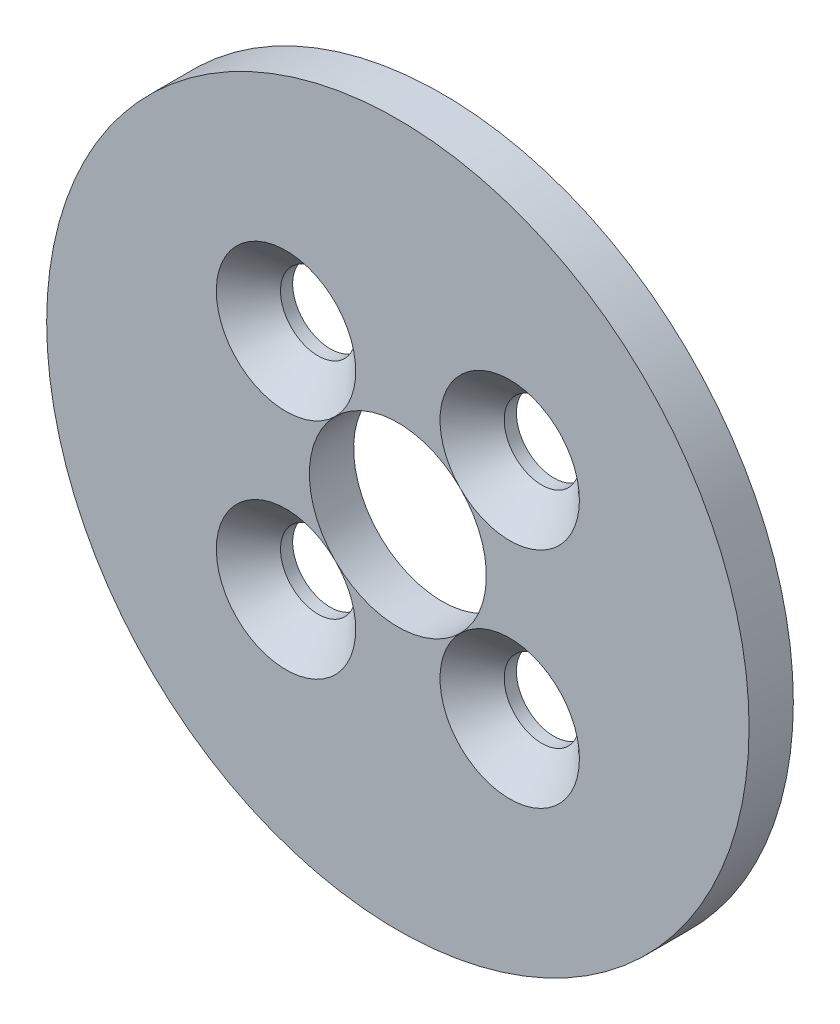
ISO-10303-21;
HEADER;
FILE_DESCRIPTION(('STEP AP214'),'2;1');
FILE_NAME('part.step','',(''),(''),'','','');
FILE_SCHEMA(('AUTOMOTIVE_DESIGN { 1 0 10303 214 1 1 1 1 }'));
ENDSEC;
DATA;
#1=APPLICATION_CONTEXT('core data for automotive mechanical design processes');
#2=APPLICATION_PROTOCOL_DEFINITION('international standard','automotive_design',2000,#1);
#3=PRODUCT_CONTEXT('',#1,'mechanical');
#4=PRODUCT('Part','Part','',(#3));
#5=PRODUCT_RELATED_PRODUCT_CATEGORY('part','',(#4));
#6=PRODUCT_DEFINITION_FORMATION('','',#4);
#7=PRODUCT_DEFINITION_CONTEXT('part definition',#1,'design');
#8=PRODUCT_DEFINITION('design','',#6,#7);
#9=PRODUCT_DEFINITION_SHAPE('','',#8);
#10=(LENGTH_UNIT() NAMED_UNIT(*) SI_UNIT(.MILLI.,.METRE.));
#11=(NAMED_UNIT(*) PLANE_ANGLE_UNIT() SI_UNIT($,.RADIAN.));
#12=(NAMED_UNIT(*) SI_UNIT($,.STERADIAN.) SOLID_ANGLE_UNIT());
#13=UNCERTAINTY_MEASURE_WITH_UNIT(LENGTH_MEASURE(1.E-05),#10,'distance_accuracy_value','');
#14=(GEOMETRIC_REPRESENTATION_CONTEXT(3) GLOBAL_UNCERTAINTY_ASSIGNED_CONTEXT((#13)) GLOBAL_UNIT_ASSIGNED_CONTEXT((#10,
#11,#12)) REPRESENTATION_CONTEXT('',''));
#15=CARTESIAN_POINT('',(0.,0.,0.));
#16=DIRECTION('',(0.,0.,1.));
#17=DIRECTION('',(1.,0.,0.));
#18=AXIS2_PLACEMENT_3D('',#15,#16,#17);
#19=CARTESIAN_POINT('',(-165.662570111801,103.941444968287,2.));
#20=DIRECTION('',(0.,0.,-1.));
#21=DIRECTION('',(-1.,0.,0.));
#22=AXIS2_PLACEMENT_3D('',#19,#20,#21);
#23=CYLINDRICAL_SURFACE('',#22,1.70000000000001);
#24=CARTESIAN_POINT('',(-165.662570111801,103.941444968287,0.));
#25=DIRECTION('',(0.,0.,1.));
#26=DIRECTION('',(1.,0.,0.));
#27=AXIS2_PLACEMENT_3D('',#24,#25,#26);
#28=CIRCLE('',#27,1.70000000000001);
#29=CARTESIAN_POINT('',(-163.962570111801,103.941444968287,0.));
#30=VERTEX_POINT('',#29);
#31=EDGE_CURVE('E98',#30,#30,#28,.T.);
#32=ORIENTED_EDGE('',*,*,#31,.F.);
#33=EDGE_LOOP('',(#32));
#34=FACE_BOUND('',#33,.T.);
#35=CARTESIAN_POINT('',(-165.662570111801,103.941444968287,0.549999999999993));
#36=DIRECTION('',(0.,0.,1.));
#37=DIRECTION('',(1.,0.,0.));
#38=AXIS2_PLACEMENT_3D('',#35,#36,#37);
#39=CIRCLE('',#38,1.69999999999998);
#40=CARTESIAN_POINT('',(-163.962570111801,103.941444968287,0.549999999999993));
#41=VERTEX_POINT('',#40);
#42=EDGE_CURVE('E202',#41,#41,#39,.T.);
#43=ORIENTED_EDGE('',*,*,#42,.T.);
#44=EDGE_LOOP('',(#43));
#45=FACE_BOUND('',#44,.T.);
#46=ADVANCED_FACE('F32',(#34,#45),#23,.F.);
#47=CARTESIAN_POINT('',(-155.550943140833,103.941444968288,2.));
#48=DIRECTION('',(0.,0.,-1.));
#49=DIRECTION('',(-1.,0.,0.));
#50=AXIS2_PLACEMENT_3D('',#47,#48,#49);
#51=CYLINDRICAL_SURFACE('',#50,1.70000000000001);
#52=CARTESIAN_POINT('',(-155.550943140833,103.941444968288,0.));
#53=DIRECTION('',(0.,0.,1.));
#54=DIRECTION('',(1.,0.,0.));
#55=AXIS2_PLACEMENT_3D('',#52,#53,#54);
#56=CIRCLE('',#55,1.70000000000001);
#57=CARTESIAN_POINT('',(-153.850943140833,103.941444968288,0.));
#58=VERTEX_POINT('',#57);
#59=EDGE_CURVE('E92',#58,#58,#56,.T.);
#60=ORIENTED_EDGE('',*,*,#59,.F.);
#61=EDGE_LOOP('',(#60));
#62=FACE_BOUND('',#61,.T.);
#63=CARTESIAN_POINT('',(-155.550943140833,103.941444968288,0.549999999999993));
#64=DIRECTION('',(0.,0.,1.));
#65=DIRECTION('',(1.,0.,0.));
#66=AXIS2_PLACEMENT_3D('',#63,#64,#65);
#67=CIRCLE('',#66,1.69999999999998);
#68=CARTESIAN_POINT('',(-153.850943140833,103.941444968288,0.549999999999993));
#69=VERTEX_POINT('',#68);
#70=EDGE_CURVE('E204',#69,#69,#67,.T.);
#71=ORIENTED_EDGE('',*,*,#70,.T.);
#72=EDGE_LOOP('',(#71));
#73=FACE_BOUND('',#72,.T.);
#74=ADVANCED_FACE('F137',(#62,#73),#51,.F.);
#75=CARTESIAN_POINT('',(-155.550943140833,93.82981799732,2.));
#76=DIRECTION('',(0.,0.,-1.));
#77=DIRECTION('',(-1.,0.,0.));
#78=AXIS2_PLACEMENT_3D('',#75,#76,#77);
#79=CYLINDRICAL_SURFACE('',#78,1.70000000000001);
#80=CARTESIAN_POINT('',(-155.550943140833,93.82981799732,0.));
#81=DIRECTION('',(0.,0.,1.));
#82=DIRECTION('',(1.,0.,0.));
#83=AXIS2_PLACEMENT_3D('',#80,#81,#82);
#84=CIRCLE('',#83,1.70000000000001);
#85=CARTESIAN_POINT('',(-153.850943140833,93.82981799732,0.));
#86=VERTEX_POINT('',#85);
#87=EDGE_CURVE('E89',#86,#86,#84,.T.);
#88=ORIENTED_EDGE('',*,*,#87,.F.);
#89=EDGE_LOOP('',(#88));
#90=FACE_BOUND('',#89,.T.);
#91=CARTESIAN_POINT('',(-155.550943140833,93.82981799732,0.549999999999993));
#92=DIRECTION('',(0.,0.,1.));
#93=DIRECTION('',(1.,0.,0.));
#94=AXIS2_PLACEMENT_3D('',#91,#92,#93);
#95=CIRCLE('',#94,1.69999999999998);
#96=CARTESIAN_POINT('',(-153.850943140833,93.82981799732,0.549999999999993));
#97=VERTEX_POINT('',#96);
#98=EDGE_CURVE('E77',#97,#97,#95,.T.);
#99=ORIENTED_EDGE('',*,*,#98,.T.);
#100=EDGE_LOOP('',(#99));
#101=FACE_BOUND('',#100,.T.);
#102=ADVANCED_FACE('F121',(#90,#101),#79,.F.);
#103=CARTESIAN_POINT('',(-165.6625701118,93.8298179973198,2.));
#104=DIRECTION('',(0.,0.,-1.));
#105=DIRECTION('',(-1.,0.,0.));
#106=AXIS2_PLACEMENT_3D('',#103,#104,#105);
#107=CYLINDRICAL_SURFACE('',#106,1.70000000000001);
#108=CARTESIAN_POINT('',(-165.6625701118,93.8298179973198,0.));
#109=DIRECTION('',(0.,0.,1.));
#110=DIRECTION('',(1.,0.,0.));
#111=AXIS2_PLACEMENT_3D('',#108,#109,#110);
#112=CIRCLE('',#111,1.70000000000001);
#113=CARTESIAN_POINT('',(-163.9625701118,93.8298179973198,0.));
#114=VERTEX_POINT('',#113);
#115=EDGE_CURVE('E80',#114,#114,#112,.T.);
#116=ORIENTED_EDGE('',*,*,#115,.F.);
#117=EDGE_LOOP('',(#116));
#118=FACE_BOUND('',#117,.T.);
#119=CARTESIAN_POINT('',(-165.6625701118,93.8298179973198,0.549999999999993));
#120=DIRECTION('',(0.,0.,1.));
#121=DIRECTION('',(1.,0.,0.));
#122=AXIS2_PLACEMENT_3D('',#119,#120,#121);
#123=CIRCLE('',#122,1.69999999999998);
#124=CARTESIAN_POINT('',(-163.9625701118,93.8298179973198,0.549999999999993));
#125=VERTEX_POINT('',#124);
#126=EDGE_CURVE('E76',#125,#125,#123,.T.);
#127=ORIENTED_EDGE('',*,*,#126,.T.);
#128=EDGE_LOOP('',(#127));
#129=FACE_BOUND('',#128,.T.);
#130=ADVANCED_FACE('F118',(#118,#129),#107,.F.);
#131=CARTESIAN_POINT('',(-160.606756626317,98.8856314828036,2.));
#132=DIRECTION('',(0.,0.,1.));
#133=DIRECTION('',(1.,0.,0.));
#134=AXIS2_PLACEMENT_3D('',#131,#132,#133);
#135=PLANE('',#134);
#136=CARTESIAN_POINT('',(-160.606756626317,98.8856314828036,2.));
#137=DIRECTION('',(0.,0.,1.));
#138=DIRECTION('',(1.,0.,0.));
#139=AXIS2_PLACEMENT_3D('',#136,#137,#138);
#140=CIRCLE('',#139,15.875);
#141=CARTESIAN_POINT('',(-144.731756626317,98.8856314828036,2.));
#142=VERTEX_POINT('',#141);
#143=EDGE_CURVE('E11',#142,#142,#140,.T.);
#144=ORIENTED_EDGE('',*,*,#143,.T.);
#145=EDGE_LOOP('',(#144));
#146=FACE_BOUND('',#145,.T.);
#147=CARTESIAN_POINT('',(-160.606756626317,98.8856314828036,2.));
#148=DIRECTION('',(0.,0.,1.));
#149=DIRECTION('',(1.,0.,0.));
#150=AXIS2_PLACEMENT_3D('',#147,#148,#149);
#151=CIRCLE('',#150,3.99999999999999);
#152=CARTESIAN_POINT('',(-163.435183751065,101.714058607548,2.));
#153=VERTEX_POINT('',#152);
#154=CARTESIAN_POINT('',(-163.435183751064,96.0572043580586,2.));
#155=VERTEX_POINT('',#154);
#156=EDGE_CURVE('E60',#153,#155,#151,.T.);
#157=ORIENTED_EDGE('',*,*,#156,.F.);
#158=CARTESIAN_POINT('',(-165.662570111801,103.941444968287,2.));
#159=DIRECTION('',(0.,0.,1.));
#160=DIRECTION('',(1.,0.,0.));
#161=AXIS2_PLACEMENT_3D('',#158,#159,#160);
#162=CIRCLE('',#161,3.15000000000001);
#163=EDGE_CURVE('E45',#153,#153,#162,.T.);
#164=ORIENTED_EDGE('',*,*,#163,.F.);
#165=CARTESIAN_POINT('',(-157.77832950157,101.714058607549,2.));
#166=VERTEX_POINT('',#165);
#167=EDGE_CURVE('E68',#166,#153,#151,.T.);
#168=ORIENTED_EDGE('',*,*,#167,.F.);
#169=CARTESIAN_POINT('',(-155.550943140833,103.941444968288,2.));
#170=DIRECTION('',(0.,0.,1.));
#171=DIRECTION('',(1.,0.,0.));
#172=AXIS2_PLACEMENT_3D('',#169,#170,#171);
#173=CIRCLE('',#172,3.15000000000001);
#174=EDGE_CURVE('E50',#166,#166,#173,.T.);
#175=ORIENTED_EDGE('',*,*,#174,.F.);
#176=CARTESIAN_POINT('',(-157.778329501571,96.0572043580566,2.));
#177=VERTEX_POINT('',#176);
#178=EDGE_CURVE('E93',#177,#166,#151,.T.);
#179=ORIENTED_EDGE('',*,*,#178,.F.);
#180=CARTESIAN_POINT('',(-155.550943140833,93.82981799732,2.));
#181=DIRECTION('',(0.,0.,1.));
#182=DIRECTION('',(1.,0.,0.));
#183=AXIS2_PLACEMENT_3D('',#180,#181,#182);
#184=CIRCLE('',#183,3.15000000000001);
#185=EDGE_CURVE('E83',#177,#177,#184,.T.);
#186=ORIENTED_EDGE('',*,*,#185,.F.);
#187=EDGE_CURVE('E66',#155,#177,#151,.T.);
#188=ORIENTED_EDGE('',*,*,#187,.F.);
#189=CARTESIAN_POINT('',(-165.6625701118,93.8298179973198,2.));
#190=DIRECTION('',(0.,0.,1.));
#191=DIRECTION('',(1.,0.,0.));
#192=AXIS2_PLACEMENT_3D('',#189,#190,#191);
#193=CIRCLE('',#192,3.14999999999999);
#194=EDGE_CURVE('E74',#155,#155,#193,.T.);
#195=ORIENTED_EDGE('',*,*,#194,.F.);
#196=EDGE_LOOP('',(#157,#164,#168,#175,#179,#186,#188,#195));
#197=FACE_BOUND('',#196,.T.);
#198=ADVANCED_FACE('F108',(#146,#197),#135,.T.);
#199=CARTESIAN_POINT('',(-160.606756626317,98.8856314828036,0.));
#200=DIRECTION('',(0.,0.,1.));
#201=DIRECTION('',(1.,0.,0.));
#202=AXIS2_PLACEMENT_3D('',#199,#200,#201);
#203=PLANE('',#202);
#204=CARTESIAN_POINT('',(-160.606756626317,98.8856314828036,0.));
#205=DIRECTION('',(0.,0.,1.));
#206=DIRECTION('',(1.,0.,0.));
#207=AXIS2_PLACEMENT_3D('',#204,#205,#206);
#208=CIRCLE('',#207,15.875);
#209=CARTESIAN_POINT('',(-144.731756626317,98.8856314828036,0.));
#210=VERTEX_POINT('',#209);
#211=EDGE_CURVE('E36',#210,#210,#208,.T.);
#212=ORIENTED_EDGE('',*,*,#211,.F.);
#213=EDGE_LOOP('',(#212));
#214=FACE_BOUND('',#213,.T.);
#215=ORIENTED_EDGE('',*,*,#31,.T.);
#216=EDGE_LOOP('',(#215));
#217=FACE_BOUND('',#216,.T.);
#218=ORIENTED_EDGE('',*,*,#59,.T.);
#219=EDGE_LOOP('',(#218));
#220=FACE_BOUND('',#219,.T.);
#221=CARTESIAN_POINT('',(-160.606756626317,98.8856314828036,0.));
#222=DIRECTION('',(0.,0.,1.));
#223=DIRECTION('',(1.,0.,0.));
#224=AXIS2_PLACEMENT_3D('',#221,#222,#223);
#225=CIRCLE('',#224,3.99999999999999);
#226=CARTESIAN_POINT('',(-156.606756626317,98.8856314828036,0.));
#227=VERTEX_POINT('',#226);
#228=EDGE_CURVE('E71',#227,#227,#225,.T.);
#229=ORIENTED_EDGE('',*,*,#228,.T.);
#230=EDGE_LOOP('',(#229));
#231=FACE_BOUND('',#230,.T.);
#232=ORIENTED_EDGE('',*,*,#87,.T.);
#233=EDGE_LOOP('',(#232));
#234=FACE_BOUND('',#233,.T.);
#235=ORIENTED_EDGE('',*,*,#115,.T.);
#236=EDGE_LOOP('',(#235));
#237=FACE_BOUND('',#236,.T.);
#238=ADVANCED_FACE('F106',(#214,#217,#220,#231,#234,#237),#203,.F.);
#239=CARTESIAN_POINT('',(-160.606756626317,98.8856314828036,2.));
#240=DIRECTION('',(0.,0.,-1.));
#241=DIRECTION('',(-1.,0.,0.));
#242=AXIS2_PLACEMENT_3D('',#239,#240,#241);
#243=CYLINDRICAL_SURFACE('',#242,15.875);
#244=ORIENTED_EDGE('',*,*,#143,.F.);
#245=EDGE_LOOP('',(#244));
#246=FACE_BOUND('',#245,.T.);
#247=ORIENTED_EDGE('',*,*,#211,.T.);
#248=EDGE_LOOP('',(#247));
#249=FACE_BOUND('',#248,.T.);
#250=ADVANCED_FACE('F34',(#246,#249),#243,.T.);
#251=CARTESIAN_POINT('',(-160.606756626317,98.8856314828036,2.));
#252=DIRECTION('',(0.,0.,-1.));
#253=DIRECTION('',(-1.,0.,0.));
#254=AXIS2_PLACEMENT_3D('',#251,#252,#253);
#255=CYLINDRICAL_SURFACE('',#254,3.99999999999999);
#256=ORIENTED_EDGE('',*,*,#187,.T.);
#257=ORIENTED_EDGE('',*,*,#178,.T.);
#258=ORIENTED_EDGE('',*,*,#167,.T.);
#259=ORIENTED_EDGE('',*,*,#156,.T.);
#260=EDGE_LOOP('',(#256,#257,#258,#259));
#261=FACE_BOUND('',#260,.T.);
#262=ORIENTED_EDGE('',*,*,#228,.F.);
#263=EDGE_LOOP('',(#262));
#264=FACE_BOUND('',#263,.T.);
#265=ADVANCED_FACE('F62',(#261,#264),#255,.F.);
#266=CARTESIAN_POINT('',(-165.6625701118,93.8298179973198,2.));
#267=DIRECTION('',(0.,0.,1.));
#268=DIRECTION('',(1.,0.,0.));
#269=AXIS2_PLACEMENT_3D('',#266,#267,#268);
#270=CONICAL_SURFACE('',#269,3.14999999999999,0.785398163397448);
#271=ORIENTED_EDGE('',*,*,#126,.F.);
#272=EDGE_LOOP('',(#271));
#273=FACE_BOUND('',#272,.T.);
#274=ORIENTED_EDGE('',*,*,#194,.T.);
#275=EDGE_LOOP('',(#274));
#276=FACE_BOUND('',#275,.T.);
#277=ADVANCED_FACE('F75',(#273,#276),#270,.F.);
#278=CARTESIAN_POINT('',(-155.550943140833,93.82981799732,2.));
#279=DIRECTION('',(0.,0.,1.));
#280=DIRECTION('',(1.,0.,0.));
#281=AXIS2_PLACEMENT_3D('',#278,#279,#280);
#282=CONICAL_SURFACE('',#281,3.15000000000001,0.785398163397457);
#283=ORIENTED_EDGE('',*,*,#98,.F.);
#284=EDGE_LOOP('',(#283));
#285=FACE_BOUND('',#284,.T.);
#286=ORIENTED_EDGE('',*,*,#185,.T.);
#287=EDGE_LOOP('',(#286));
#288=FACE_BOUND('',#287,.T.);
#289=ADVANCED_FACE('F126',(#285,#288),#282,.F.);
#290=CARTESIAN_POINT('',(-155.550943140833,103.941444968288,2.));
#291=DIRECTION('',(0.,0.,1.));
#292=DIRECTION('',(1.,0.,0.));
#293=AXIS2_PLACEMENT_3D('',#290,#291,#292);
#294=CONICAL_SURFACE('',#293,3.15000000000001,0.785398163397457);
#295=ORIENTED_EDGE('',*,*,#70,.F.);
#296=EDGE_LOOP('',(#295));
#297=FACE_BOUND('',#296,.T.);
#298=ORIENTED_EDGE('',*,*,#174,.T.);
#299=EDGE_LOOP('',(#298));
#300=FACE_BOUND('',#299,.T.);
#301=ADVANCED_FACE('F132',(#297,#300),#294,.F.);
#302=CARTESIAN_POINT('',(-165.662570111801,103.941444968287,2.));
#303=DIRECTION('',(0.,0.,1.));
#304=DIRECTION('',(1.,0.,0.));
#305=AXIS2_PLACEMENT_3D('',#302,#303,#304);
#306=CONICAL_SURFACE('',#305,3.15000000000001,0.785398163397457);
#307=ORIENTED_EDGE('',*,*,#42,.F.);
#308=EDGE_LOOP('',(#307));
#309=FACE_BOUND('',#308,.T.);
#310=ORIENTED_EDGE('',*,*,#163,.T.);
#311=EDGE_LOOP('',(#310));
#312=FACE_BOUND('',#311,.T.);
#313=ADVANCED_FACE('F186',(#309,#312),#306,.F.);
#314=CLOSED_SHELL('',(#46,#74,#102,#130,#198,#238,#250,#265,#277,#289,#301,#313));
#315=MANIFOLD_SOLID_BREP('B2',#314);
#316=ADVANCED_BREP_SHAPE_REPRESENTATION('',(#18,#315),#14);
#317=SHAPE_DEFINITION_REPRESENTATION(#9,#316);
ENDSEC;
END-ISO-10303-21;
